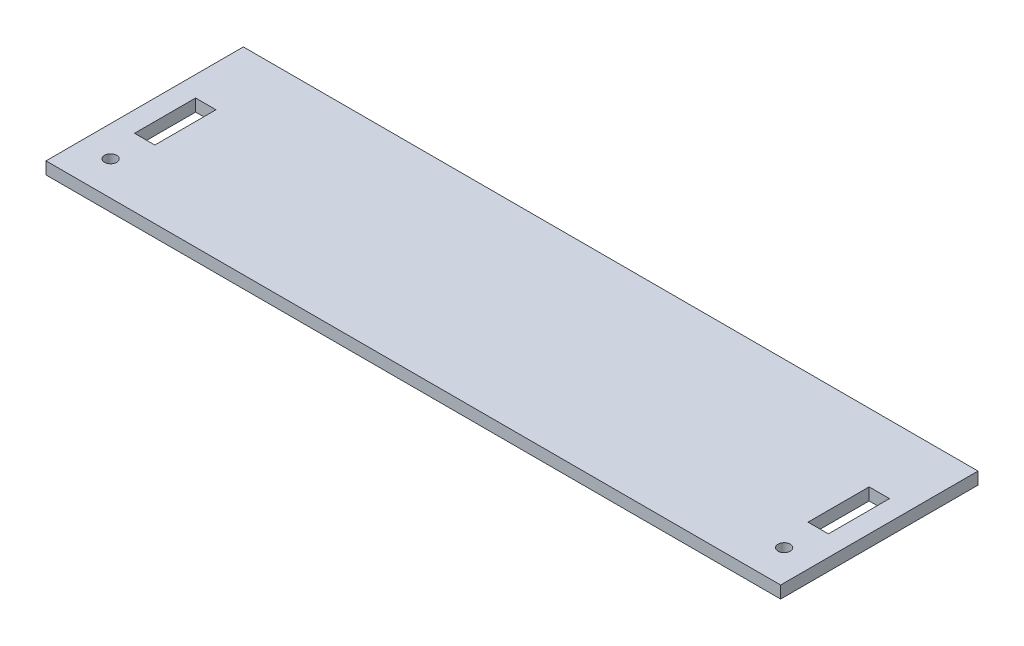
ISO-10303-21;
HEADER;
FILE_DESCRIPTION(('STEP AP214'),'2;1');
FILE_NAME('part.step','',(''),(''),'','','');
FILE_SCHEMA(('AUTOMOTIVE_DESIGN { 1 0 10303 214 1 1 1 1 }'));
ENDSEC;
DATA;
#1=APPLICATION_CONTEXT('core data for automotive mechanical design processes');
#2=APPLICATION_PROTOCOL_DEFINITION('international standard','automotive_design',2000,#1);
#3=PRODUCT_CONTEXT('',#1,'mechanical');
#4=PRODUCT('Part','Part','',(#3));
#5=PRODUCT_RELATED_PRODUCT_CATEGORY('part','',(#4));
#6=PRODUCT_DEFINITION_FORMATION('','',#4);
#7=PRODUCT_DEFINITION_CONTEXT('part definition',#1,'design');
#8=PRODUCT_DEFINITION('design','',#6,#7);
#9=PRODUCT_DEFINITION_SHAPE('','',#8);
#10=(LENGTH_UNIT() NAMED_UNIT(*) SI_UNIT(.MILLI.,.METRE.));
#11=(NAMED_UNIT(*) PLANE_ANGLE_UNIT() SI_UNIT($,.RADIAN.));
#12=(NAMED_UNIT(*) SI_UNIT($,.STERADIAN.) SOLID_ANGLE_UNIT());
#13=UNCERTAINTY_MEASURE_WITH_UNIT(LENGTH_MEASURE(1.E-05),#10,'distance_accuracy_value','');
#14=(GEOMETRIC_REPRESENTATION_CONTEXT(3) GLOBAL_UNCERTAINTY_ASSIGNED_CONTEXT((#13)) GLOBAL_UNIT_ASSIGNED_CONTEXT((#10,
#11,#12)) REPRESENTATION_CONTEXT('',''));
#15=CARTESIAN_POINT('',(0.,0.,0.));
#16=DIRECTION('',(0.,0.,1.));
#17=DIRECTION('',(1.,0.,0.));
#18=AXIS2_PLACEMENT_3D('',#15,#16,#17);
#19=CARTESIAN_POINT('',(0.,3.,0.));
#20=DIRECTION('',(0.,1.,0.));
#21=DIRECTION('',(0.,0.,1.));
#22=AXIS2_PLACEMENT_3D('',#19,#20,#21);
#23=PLANE('',#22);
#24=CARTESIAN_POINT('',(82.6700000000001,3.,15.8625));
#25=DIRECTION('',(0.,1.,0.));
#26=DIRECTION('',(0.,0.,-1.));
#27=AXIS2_PLACEMENT_3D('',#24,#25,#26);
#28=CIRCLE('',#27,1.5);
#29=CARTESIAN_POINT('',(82.6700000000001,3.,14.3625));
#30=VERTEX_POINT('',#29);
#31=EDGE_CURVE('E313',#30,#30,#28,.T.);
#32=ORIENTED_EDGE('',*,*,#31,.F.);
#33=EDGE_LOOP('',(#32));
#34=FACE_BOUND('',#33,.T.);
#35=CARTESIAN_POINT('',(-82.6700000000001,3.,15.8625));
#36=DIRECTION('',(0.,1.,0.));
#37=DIRECTION('',(0.,0.,1.));
#38=AXIS2_PLACEMENT_3D('',#35,#36,#37);
#39=CIRCLE('',#38,1.5);
#40=CARTESIAN_POINT('',(-82.6700000000001,3.,17.3625));
#41=VERTEX_POINT('',#40);
#42=EDGE_CURVE('E154',#41,#41,#39,.T.);
#43=ORIENTED_EDGE('',*,*,#42,.F.);
#44=EDGE_LOOP('',(#43));
#45=FACE_BOUND('',#44,.T.);
#46=DIRECTION('',(0.,0.,1.));
#47=VECTOR('',#46,1.);
#48=CARTESIAN_POINT('',(-90.17,3.,-24.225));
#49=LINE('',#48,#47);
#50=CARTESIAN_POINT('',(-90.17,3.,-24.225));
#51=VERTEX_POINT('',#50);
#52=CARTESIAN_POINT('',(-90.17,3.,24.225));
#53=VERTEX_POINT('',#52);
#54=EDGE_CURVE('E195',#51,#53,#49,.T.);
#55=ORIENTED_EDGE('',*,*,#54,.T.);
#56=DIRECTION('',(1.,0.,0.));
#57=VECTOR('',#56,1.);
#58=CARTESIAN_POINT('',(-90.17,3.,24.225));
#59=LINE('',#58,#57);
#60=CARTESIAN_POINT('',(90.17,3.,24.225));
#61=VERTEX_POINT('',#60);
#62=EDGE_CURVE('E198',#53,#61,#59,.T.);
#63=ORIENTED_EDGE('',*,*,#62,.T.);
#64=DIRECTION('',(0.,0.,-1.));
#65=VECTOR('',#64,1.);
#66=CARTESIAN_POINT('',(90.17,3.,-24.225));
#67=LINE('',#66,#65);
#68=CARTESIAN_POINT('',(90.17,3.,-24.225));
#69=VERTEX_POINT('',#68);
#70=EDGE_CURVE('E201',#61,#69,#67,.T.);
#71=ORIENTED_EDGE('',*,*,#70,.T.);
#72=DIRECTION('',(-1.,0.,0.));
#73=VECTOR('',#72,1.);
#74=CARTESIAN_POINT('',(-90.17,3.,-24.225));
#75=LINE('',#74,#73);
#76=EDGE_CURVE('E203',#69,#51,#75,.T.);
#77=ORIENTED_EDGE('',*,*,#76,.T.);
#78=EDGE_LOOP('',(#55,#63,#71,#77));
#79=FACE_BOUND('',#78,.T.);
#80=DIRECTION('',(1.,0.,0.));
#81=VECTOR('',#80,1.);
#82=CARTESIAN_POINT('',(-85.17,3.,7.5));
#83=LINE('',#82,#81);
#84=CARTESIAN_POINT('',(-85.17,3.,7.5));
#85=VERTEX_POINT('',#84);
#86=CARTESIAN_POINT('',(-80.17,3.,7.5));
#87=VERTEX_POINT('',#86);
#88=EDGE_CURVE('E166',#85,#87,#83,.T.);
#89=ORIENTED_EDGE('',*,*,#88,.F.);
#90=DIRECTION('',(0.,0.,1.));
#91=VECTOR('',#90,1.);
#92=CARTESIAN_POINT('',(-85.17,3.,-7.5));
#93=LINE('',#92,#91);
#94=CARTESIAN_POINT('',(-85.17,3.,-7.5));
#95=VERTEX_POINT('',#94);
#96=EDGE_CURVE('E164',#95,#85,#93,.T.);
#97=ORIENTED_EDGE('',*,*,#96,.F.);
#98=DIRECTION('',(-1.,0.,0.));
#99=VECTOR('',#98,1.);
#100=CARTESIAN_POINT('',(-85.17,3.,-7.5));
#101=LINE('',#100,#99);
#102=CARTESIAN_POINT('',(-80.17,3.,-7.5));
#103=VERTEX_POINT('',#102);
#104=EDGE_CURVE('E172',#103,#95,#101,.T.);
#105=ORIENTED_EDGE('',*,*,#104,.F.);
#106=DIRECTION('',(0.,0.,-1.));
#107=VECTOR('',#106,1.);
#108=CARTESIAN_POINT('',(-80.17,3.,-7.5));
#109=LINE('',#108,#107);
#110=EDGE_CURVE('E169',#87,#103,#109,.T.);
#111=ORIENTED_EDGE('',*,*,#110,.F.);
#112=EDGE_LOOP('',(#89,#97,#105,#111));
#113=FACE_BOUND('',#112,.T.);
#114=DIRECTION('',(-1.,0.,0.));
#115=VECTOR('',#114,1.);
#116=CARTESIAN_POINT('',(85.17,3.,-7.5));
#117=LINE('',#116,#115);
#118=CARTESIAN_POINT('',(85.17,3.,-7.5));
#119=VERTEX_POINT('',#118);
#120=CARTESIAN_POINT('',(80.17,3.,-7.5));
#121=VERTEX_POINT('',#120);
#122=EDGE_CURVE('E134',#119,#121,#117,.T.);
#123=ORIENTED_EDGE('',*,*,#122,.F.);
#124=DIRECTION('',(0.,0.,-1.));
#125=VECTOR('',#124,1.);
#126=CARTESIAN_POINT('',(85.17,3.,-7.5));
#127=LINE('',#126,#125);
#128=CARTESIAN_POINT('',(85.17,3.,7.5));
#129=VERTEX_POINT('',#128);
#130=EDGE_CURVE('E126',#129,#119,#127,.T.);
#131=ORIENTED_EDGE('',*,*,#130,.F.);
#132=DIRECTION('',(1.,0.,0.));
#133=VECTOR('',#132,1.);
#134=CARTESIAN_POINT('',(85.17,3.,7.5));
#135=LINE('',#134,#133);
#136=CARTESIAN_POINT('',(80.17,3.,7.5));
#137=VERTEX_POINT('',#136);
#138=EDGE_CURVE('E148',#137,#129,#135,.T.);
#139=ORIENTED_EDGE('',*,*,#138,.F.);
#140=DIRECTION('',(0.,0.,1.));
#141=VECTOR('',#140,1.);
#142=CARTESIAN_POINT('',(80.17,3.,-7.5));
#143=LINE('',#142,#141);
#144=EDGE_CURVE('E146',#121,#137,#143,.T.);
#145=ORIENTED_EDGE('',*,*,#144,.F.);
#146=EDGE_LOOP('',(#123,#131,#139,#145));
#147=FACE_BOUND('',#146,.T.);
#148=ADVANCED_FACE('F37',(#34,#45,#79,#113,#147),#23,.T.);
#149=CARTESIAN_POINT('',(0.,0.,0.));
#150=DIRECTION('',(0.,1.,0.));
#151=DIRECTION('',(0.,0.,1.));
#152=AXIS2_PLACEMENT_3D('',#149,#150,#151);
#153=PLANE('',#152);
#154=CARTESIAN_POINT('',(82.6700000000001,0.,15.8625));
#155=DIRECTION('',(0.,1.,0.));
#156=DIRECTION('',(0.,0.,-1.));
#157=AXIS2_PLACEMENT_3D('',#154,#155,#156);
#158=CIRCLE('',#157,1.5);
#159=CARTESIAN_POINT('',(82.6700000000001,0.,14.3625));
#160=VERTEX_POINT('',#159);
#161=EDGE_CURVE('E316',#160,#160,#158,.T.);
#162=ORIENTED_EDGE('',*,*,#161,.T.);
#163=EDGE_LOOP('',(#162));
#164=FACE_BOUND('',#163,.T.);
#165=CARTESIAN_POINT('',(-82.6700000000001,0.,15.8625));
#166=DIRECTION('',(0.,1.,0.));
#167=DIRECTION('',(0.,0.,1.));
#168=AXIS2_PLACEMENT_3D('',#165,#166,#167);
#169=CIRCLE('',#168,1.5);
#170=CARTESIAN_POINT('',(-82.6700000000001,0.,17.3625));
#171=VERTEX_POINT('',#170);
#172=EDGE_CURVE('E318',#171,#171,#169,.T.);
#173=ORIENTED_EDGE('',*,*,#172,.T.);
#174=EDGE_LOOP('',(#173));
#175=FACE_BOUND('',#174,.T.);
#176=DIRECTION('',(0.,0.,1.));
#177=VECTOR('',#176,1.);
#178=CARTESIAN_POINT('',(-85.17,0.,-7.5));
#179=LINE('',#178,#177);
#180=CARTESIAN_POINT('',(-85.17,0.,-7.5));
#181=VERTEX_POINT('',#180);
#182=CARTESIAN_POINT('',(-85.17,0.,7.5));
#183=VERTEX_POINT('',#182);
#184=EDGE_CURVE('E142',#181,#183,#179,.T.);
#185=ORIENTED_EDGE('',*,*,#184,.T.);
#186=DIRECTION('',(1.,0.,0.));
#187=VECTOR('',#186,1.);
#188=CARTESIAN_POINT('',(-85.17,0.,7.5));
#189=LINE('',#188,#187);
#190=CARTESIAN_POINT('',(-80.17,0.,7.5));
#191=VERTEX_POINT('',#190);
#192=EDGE_CURVE('E177',#183,#191,#189,.T.);
#193=ORIENTED_EDGE('',*,*,#192,.T.);
#194=DIRECTION('',(0.,0.,-1.));
#195=VECTOR('',#194,1.);
#196=CARTESIAN_POINT('',(-80.17,0.,-7.5));
#197=LINE('',#196,#195);
#198=CARTESIAN_POINT('',(-80.17,0.,-7.5));
#199=VERTEX_POINT('',#198);
#200=EDGE_CURVE('E180',#191,#199,#197,.T.);
#201=ORIENTED_EDGE('',*,*,#200,.T.);
#202=DIRECTION('',(-1.,0.,0.));
#203=VECTOR('',#202,1.);
#204=CARTESIAN_POINT('',(-85.17,0.,-7.5));
#205=LINE('',#204,#203);
#206=EDGE_CURVE('E167',#199,#181,#205,.T.);
#207=ORIENTED_EDGE('',*,*,#206,.T.);
#208=EDGE_LOOP('',(#185,#193,#201,#207));
#209=FACE_BOUND('',#208,.T.);
#210=DIRECTION('',(0.,0.,1.));
#211=VECTOR('',#210,1.);
#212=CARTESIAN_POINT('',(-90.17,0.,-24.225));
#213=LINE('',#212,#211);
#214=CARTESIAN_POINT('',(-90.17,0.,-24.225));
#215=VERTEX_POINT('',#214);
#216=CARTESIAN_POINT('',(-90.17,0.,24.225));
#217=VERTEX_POINT('',#216);
#218=EDGE_CURVE('E194',#215,#217,#213,.T.);
#219=ORIENTED_EDGE('',*,*,#218,.F.);
#220=DIRECTION('',(-1.,0.,0.));
#221=VECTOR('',#220,1.);
#222=CARTESIAN_POINT('',(-90.17,0.,-24.225));
#223=LINE('',#222,#221);
#224=CARTESIAN_POINT('',(90.17,0.,-24.225));
#225=VERTEX_POINT('',#224);
#226=EDGE_CURVE('E199',#225,#215,#223,.T.);
#227=ORIENTED_EDGE('',*,*,#226,.F.);
#228=DIRECTION('',(0.,0.,-1.));
#229=VECTOR('',#228,1.);
#230=CARTESIAN_POINT('',(90.17,0.,-24.225));
#231=LINE('',#230,#229);
#232=CARTESIAN_POINT('',(90.17,0.,24.225));
#233=VERTEX_POINT('',#232);
#234=EDGE_CURVE('E210',#233,#225,#231,.T.);
#235=ORIENTED_EDGE('',*,*,#234,.F.);
#236=DIRECTION('',(1.,0.,0.));
#237=VECTOR('',#236,1.);
#238=CARTESIAN_POINT('',(-90.17,0.,24.225));
#239=LINE('',#238,#237);
#240=EDGE_CURVE('E208',#217,#233,#239,.T.);
#241=ORIENTED_EDGE('',*,*,#240,.F.);
#242=EDGE_LOOP('',(#219,#227,#235,#241));
#243=FACE_BOUND('',#242,.T.);
#244=DIRECTION('',(0.,0.,-1.));
#245=VECTOR('',#244,1.);
#246=CARTESIAN_POINT('',(85.17,0.,-7.5));
#247=LINE('',#246,#245);
#248=CARTESIAN_POINT('',(85.17,0.,7.5));
#249=VERTEX_POINT('',#248);
#250=CARTESIAN_POINT('',(85.17,0.,-7.5));
#251=VERTEX_POINT('',#250);
#252=EDGE_CURVE('E60',#249,#251,#247,.T.);
#253=ORIENTED_EDGE('',*,*,#252,.T.);
#254=DIRECTION('',(-1.,0.,0.));
#255=VECTOR('',#254,1.);
#256=CARTESIAN_POINT('',(85.17,0.,-7.5));
#257=LINE('',#256,#255);
#258=CARTESIAN_POINT('',(80.17,0.,-7.5));
#259=VERTEX_POINT('',#258);
#260=EDGE_CURVE('E141',#251,#259,#257,.T.);
#261=ORIENTED_EDGE('',*,*,#260,.T.);
#262=DIRECTION('',(0.,0.,1.));
#263=VECTOR('',#262,1.);
#264=CARTESIAN_POINT('',(80.17,0.,-7.5));
#265=LINE('',#264,#263);
#266=CARTESIAN_POINT('',(80.17,0.,7.5));
#267=VERTEX_POINT('',#266);
#268=EDGE_CURVE('E156',#259,#267,#265,.T.);
#269=ORIENTED_EDGE('',*,*,#268,.T.);
#270=DIRECTION('',(1.,0.,0.));
#271=VECTOR('',#270,1.);
#272=CARTESIAN_POINT('',(85.17,0.,7.5));
#273=LINE('',#272,#271);
#274=EDGE_CURVE('E135',#267,#249,#273,.T.);
#275=ORIENTED_EDGE('',*,*,#274,.T.);
#276=EDGE_LOOP('',(#253,#261,#269,#275));
#277=FACE_BOUND('',#276,.T.);
#278=ADVANCED_FACE('F228',(#164,#175,#209,#243,#277),#153,.F.);
#279=CARTESIAN_POINT('',(-90.17,3.,-24.225));
#280=DIRECTION('',(1.,0.,0.));
#281=DIRECTION('',(0.,0.,-1.));
#282=AXIS2_PLACEMENT_3D('',#279,#280,#281);
#283=PLANE('',#282);
#284=ORIENTED_EDGE('',*,*,#218,.T.);
#285=DIRECTION('',(0.,-1.,0.));
#286=VECTOR('',#285,1.);
#287=CARTESIAN_POINT('',(-90.17,3.,24.225));
#288=LINE('',#287,#286);
#289=EDGE_CURVE('E11',#53,#217,#288,.T.);
#290=ORIENTED_EDGE('',*,*,#289,.F.);
#291=ORIENTED_EDGE('',*,*,#54,.F.);
#292=DIRECTION('',(0.,-1.,0.));
#293=VECTOR('',#292,1.);
#294=CARTESIAN_POINT('',(-90.17,3.,-24.225));
#295=LINE('',#294,#293);
#296=EDGE_CURVE('E205',#51,#215,#295,.T.);
#297=ORIENTED_EDGE('',*,*,#296,.T.);
#298=EDGE_LOOP('',(#284,#290,#291,#297));
#299=FACE_BOUND('',#298,.T.);
#300=ADVANCED_FACE('F39',(#299),#283,.F.);
#301=CARTESIAN_POINT('',(-90.17,3.,24.225));
#302=DIRECTION('',(0.,0.,-1.));
#303=DIRECTION('',(-1.,0.,0.));
#304=AXIS2_PLACEMENT_3D('',#301,#302,#303);
#305=PLANE('',#304);
#306=ORIENTED_EDGE('',*,*,#240,.T.);
#307=DIRECTION('',(0.,-1.,0.));
#308=VECTOR('',#307,1.);
#309=CARTESIAN_POINT('',(90.17,3.,24.225));
#310=LINE('',#309,#308);
#311=EDGE_CURVE('E45',#61,#233,#310,.T.);
#312=ORIENTED_EDGE('',*,*,#311,.F.);
#313=ORIENTED_EDGE('',*,*,#62,.F.);
#314=ORIENTED_EDGE('',*,*,#289,.T.);
#315=EDGE_LOOP('',(#306,#312,#313,#314));
#316=FACE_BOUND('',#315,.T.);
#317=ADVANCED_FACE('F239',(#316),#305,.F.);
#318=CARTESIAN_POINT('',(90.17,3.,-24.225));
#319=DIRECTION('',(-1.,0.,0.));
#320=DIRECTION('',(0.,0.,1.));
#321=AXIS2_PLACEMENT_3D('',#318,#319,#320);
#322=PLANE('',#321);
#323=ORIENTED_EDGE('',*,*,#234,.T.);
#324=DIRECTION('',(0.,-1.,0.));
#325=VECTOR('',#324,1.);
#326=CARTESIAN_POINT('',(90.17,3.,-24.225));
#327=LINE('',#326,#325);
#328=EDGE_CURVE('E215',#69,#225,#327,.T.);
#329=ORIENTED_EDGE('',*,*,#328,.F.);
#330=ORIENTED_EDGE('',*,*,#70,.F.);
#331=ORIENTED_EDGE('',*,*,#311,.T.);
#332=EDGE_LOOP('',(#323,#329,#330,#331));
#333=FACE_BOUND('',#332,.T.);
#334=ADVANCED_FACE('F222',(#333),#322,.F.);
#335=CARTESIAN_POINT('',(-90.17,3.,-24.225));
#336=DIRECTION('',(0.,0.,1.));
#337=DIRECTION('',(1.,0.,0.));
#338=AXIS2_PLACEMENT_3D('',#335,#336,#337);
#339=PLANE('',#338);
#340=ORIENTED_EDGE('',*,*,#226,.T.);
#341=ORIENTED_EDGE('',*,*,#296,.F.);
#342=ORIENTED_EDGE('',*,*,#76,.F.);
#343=ORIENTED_EDGE('',*,*,#328,.T.);
#344=EDGE_LOOP('',(#340,#341,#342,#343));
#345=FACE_BOUND('',#344,.T.);
#346=ADVANCED_FACE('F232',(#345),#339,.F.);
#347=CARTESIAN_POINT('',(-85.17,3.,-7.5));
#348=DIRECTION('',(1.,0.,0.));
#349=DIRECTION('',(0.,0.,-1.));
#350=AXIS2_PLACEMENT_3D('',#347,#348,#349);
#351=PLANE('',#350);
#352=ORIENTED_EDGE('',*,*,#184,.F.);
#353=DIRECTION('',(0.,-1.,0.));
#354=VECTOR('',#353,1.);
#355=CARTESIAN_POINT('',(-85.17,3.,-7.5));
#356=LINE('',#355,#354);
#357=EDGE_CURVE('E174',#95,#181,#356,.T.);
#358=ORIENTED_EDGE('',*,*,#357,.F.);
#359=ORIENTED_EDGE('',*,*,#96,.T.);
#360=DIRECTION('',(0.,-1.,0.));
#361=VECTOR('',#360,1.);
#362=CARTESIAN_POINT('',(-85.17,3.,7.5));
#363=LINE('',#362,#361);
#364=EDGE_CURVE('E191',#85,#183,#363,.T.);
#365=ORIENTED_EDGE('',*,*,#364,.T.);
#366=EDGE_LOOP('',(#352,#358,#359,#365));
#367=FACE_BOUND('',#366,.T.);
#368=ADVANCED_FACE('F257',(#367),#351,.T.);
#369=CARTESIAN_POINT('',(-85.17,3.,7.5));
#370=DIRECTION('',(0.,0.,-1.));
#371=DIRECTION('',(-1.,0.,0.));
#372=AXIS2_PLACEMENT_3D('',#369,#370,#371);
#373=PLANE('',#372);
#374=ORIENTED_EDGE('',*,*,#192,.F.);
#375=ORIENTED_EDGE('',*,*,#364,.F.);
#376=ORIENTED_EDGE('',*,*,#88,.T.);
#377=DIRECTION('',(0.,-1.,0.));
#378=VECTOR('',#377,1.);
#379=CARTESIAN_POINT('',(-80.17,3.,7.5));
#380=LINE('',#379,#378);
#381=EDGE_CURVE('E189',#87,#191,#380,.T.);
#382=ORIENTED_EDGE('',*,*,#381,.T.);
#383=EDGE_LOOP('',(#374,#375,#376,#382));
#384=FACE_BOUND('',#383,.T.);
#385=ADVANCED_FACE('F264',(#384),#373,.T.);
#386=CARTESIAN_POINT('',(-80.17,3.,-7.5));
#387=DIRECTION('',(-1.,0.,0.));
#388=DIRECTION('',(0.,0.,1.));
#389=AXIS2_PLACEMENT_3D('',#386,#387,#388);
#390=PLANE('',#389);
#391=ORIENTED_EDGE('',*,*,#200,.F.);
#392=ORIENTED_EDGE('',*,*,#381,.F.);
#393=ORIENTED_EDGE('',*,*,#110,.T.);
#394=DIRECTION('',(0.,-1.,0.));
#395=VECTOR('',#394,1.);
#396=CARTESIAN_POINT('',(-80.17,3.,-7.5));
#397=LINE('',#396,#395);
#398=EDGE_CURVE('E187',#103,#199,#397,.T.);
#399=ORIENTED_EDGE('',*,*,#398,.T.);
#400=EDGE_LOOP('',(#391,#392,#393,#399));
#401=FACE_BOUND('',#400,.T.);
#402=ADVANCED_FACE('F269',(#401),#390,.T.);
#403=CARTESIAN_POINT('',(-85.17,3.,-7.5));
#404=DIRECTION('',(0.,0.,1.));
#405=DIRECTION('',(1.,0.,0.));
#406=AXIS2_PLACEMENT_3D('',#403,#404,#405);
#407=PLANE('',#406);
#408=ORIENTED_EDGE('',*,*,#206,.F.);
#409=ORIENTED_EDGE('',*,*,#398,.F.);
#410=ORIENTED_EDGE('',*,*,#104,.T.);
#411=ORIENTED_EDGE('',*,*,#357,.T.);
#412=EDGE_LOOP('',(#408,#409,#410,#411));
#413=FACE_BOUND('',#412,.T.);
#414=ADVANCED_FACE('F277',(#413),#407,.T.);
#415=CARTESIAN_POINT('',(85.17,3.,-7.5));
#416=DIRECTION('',(-1.,0.,0.));
#417=DIRECTION('',(0.,0.,1.));
#418=AXIS2_PLACEMENT_3D('',#415,#416,#417);
#419=PLANE('',#418);
#420=ORIENTED_EDGE('',*,*,#252,.F.);
#421=DIRECTION('',(0.,-1.,0.));
#422=VECTOR('',#421,1.);
#423=CARTESIAN_POINT('',(85.17,3.,7.5));
#424=LINE('',#423,#422);
#425=EDGE_CURVE('E130',#129,#249,#424,.T.);
#426=ORIENTED_EDGE('',*,*,#425,.F.);
#427=ORIENTED_EDGE('',*,*,#130,.T.);
#428=DIRECTION('',(0.,-1.,0.));
#429=VECTOR('',#428,1.);
#430=CARTESIAN_POINT('',(85.17,3.,-7.5));
#431=LINE('',#430,#429);
#432=EDGE_CURVE('E129',#119,#251,#431,.T.);
#433=ORIENTED_EDGE('',*,*,#432,.T.);
#434=EDGE_LOOP('',(#420,#426,#427,#433));
#435=FACE_BOUND('',#434,.T.);
#436=ADVANCED_FACE('F128',(#435),#419,.T.);
#437=CARTESIAN_POINT('',(85.17,3.,-7.5));
#438=DIRECTION('',(0.,0.,1.));
#439=DIRECTION('',(1.,0.,0.));
#440=AXIS2_PLACEMENT_3D('',#437,#438,#439);
#441=PLANE('',#440);
#442=ORIENTED_EDGE('',*,*,#260,.F.);
#443=ORIENTED_EDGE('',*,*,#432,.F.);
#444=ORIENTED_EDGE('',*,*,#122,.T.);
#445=DIRECTION('',(0.,-1.,0.));
#446=VECTOR('',#445,1.);
#447=CARTESIAN_POINT('',(80.17,3.,-7.5));
#448=LINE('',#447,#446);
#449=EDGE_CURVE('E143',#121,#259,#448,.T.);
#450=ORIENTED_EDGE('',*,*,#449,.T.);
#451=EDGE_LOOP('',(#442,#443,#444,#450));
#452=FACE_BOUND('',#451,.T.);
#453=ADVANCED_FACE('F138',(#452),#441,.T.);
#454=CARTESIAN_POINT('',(80.17,3.,-7.5));
#455=DIRECTION('',(1.,0.,0.));
#456=DIRECTION('',(0.,0.,-1.));
#457=AXIS2_PLACEMENT_3D('',#454,#455,#456);
#458=PLANE('',#457);
#459=ORIENTED_EDGE('',*,*,#268,.F.);
#460=ORIENTED_EDGE('',*,*,#449,.F.);
#461=ORIENTED_EDGE('',*,*,#144,.T.);
#462=DIRECTION('',(0.,-1.,0.));
#463=VECTOR('',#462,1.);
#464=CARTESIAN_POINT('',(80.17,3.,7.5));
#465=LINE('',#464,#463);
#466=EDGE_CURVE('E52',#137,#267,#465,.T.);
#467=ORIENTED_EDGE('',*,*,#466,.T.);
#468=EDGE_LOOP('',(#459,#460,#461,#467));
#469=FACE_BOUND('',#468,.T.);
#470=ADVANCED_FACE('F295',(#469),#458,.T.);
#471=CARTESIAN_POINT('',(85.17,3.,7.5));
#472=DIRECTION('',(0.,0.,-1.));
#473=DIRECTION('',(-1.,0.,0.));
#474=AXIS2_PLACEMENT_3D('',#471,#472,#473);
#475=PLANE('',#474);
#476=ORIENTED_EDGE('',*,*,#274,.F.);
#477=ORIENTED_EDGE('',*,*,#466,.F.);
#478=ORIENTED_EDGE('',*,*,#138,.T.);
#479=ORIENTED_EDGE('',*,*,#425,.T.);
#480=EDGE_LOOP('',(#476,#477,#478,#479));
#481=FACE_BOUND('',#480,.T.);
#482=ADVANCED_FACE('F298',(#481),#475,.T.);
#483=CARTESIAN_POINT('',(-82.6700000000001,3.,15.8625));
#484=DIRECTION('',(0.,-1.,0.));
#485=DIRECTION('',(0.,0.,-1.));
#486=AXIS2_PLACEMENT_3D('',#483,#484,#485);
#487=CYLINDRICAL_SURFACE('',#486,1.5);
#488=ORIENTED_EDGE('',*,*,#42,.T.);
#489=EDGE_LOOP('',(#488));
#490=FACE_BOUND('',#489,.T.);
#491=ORIENTED_EDGE('',*,*,#172,.F.);
#492=EDGE_LOOP('',(#491));
#493=FACE_BOUND('',#492,.T.);
#494=ADVANCED_FACE('F302',(#490,#493),#487,.F.);
#495=CARTESIAN_POINT('',(82.6700000000001,3.,15.8625));
#496=DIRECTION('',(0.,-1.,0.));
#497=DIRECTION('',(0.,0.,-1.));
#498=AXIS2_PLACEMENT_3D('',#495,#496,#497);
#499=CYLINDRICAL_SURFACE('',#498,1.5);
#500=ORIENTED_EDGE('',*,*,#31,.T.);
#501=EDGE_LOOP('',(#500));
#502=FACE_BOUND('',#501,.T.);
#503=ORIENTED_EDGE('',*,*,#161,.F.);
#504=EDGE_LOOP('',(#503));
#505=FACE_BOUND('',#504,.T.);
#506=ADVANCED_FACE('F305',(#502,#505),#499,.F.);
#507=CLOSED_SHELL('',(#148,#278,#300,#317,#334,#346,#368,#385,#402,#414,#436,#453,#470,#482,
#494,#506));
#508=MANIFOLD_SOLID_BREP('B2',#507);
#509=ADVANCED_BREP_SHAPE_REPRESENTATION('',(#18,#508),#14);
#510=SHAPE_DEFINITION_REPRESENTATION(#9,#509);
ENDSEC;
END-ISO-10303-21;
